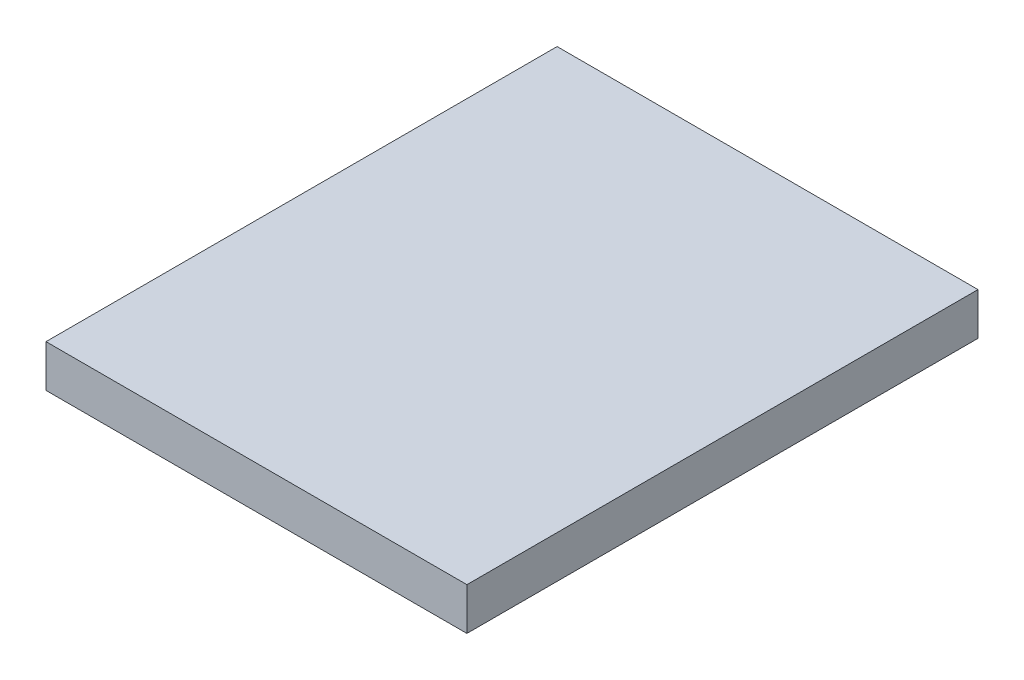
ISO-10303-21;
HEADER;
FILE_DESCRIPTION(('STEP AP214'),'2;1');
FILE_NAME('part.step','',(''),(''),'','','');
FILE_SCHEMA(('AUTOMOTIVE_DESIGN { 1 0 10303 214 1 1 1 1 }'));
ENDSEC;
DATA;
#1=APPLICATION_CONTEXT('core data for automotive mechanical design processes');
#2=APPLICATION_PROTOCOL_DEFINITION('international standard','automotive_design',2000,#1);
#3=PRODUCT_CONTEXT('',#1,'mechanical');
#4=PRODUCT('Part','Part','',(#3));
#5=PRODUCT_RELATED_PRODUCT_CATEGORY('part','',(#4));
#6=PRODUCT_DEFINITION_FORMATION('','',#4);
#7=PRODUCT_DEFINITION_CONTEXT('part definition',#1,'design');
#8=PRODUCT_DEFINITION('design','',#6,#7);
#9=PRODUCT_DEFINITION_SHAPE('','',#8);
#10=(LENGTH_UNIT() NAMED_UNIT(*) SI_UNIT(.MILLI.,.METRE.));
#11=(NAMED_UNIT(*) PLANE_ANGLE_UNIT() SI_UNIT($,.RADIAN.));
#12=(NAMED_UNIT(*) SI_UNIT($,.STERADIAN.) SOLID_ANGLE_UNIT());
#13=UNCERTAINTY_MEASURE_WITH_UNIT(LENGTH_MEASURE(1.E-05),#10,'distance_accuracy_value','');
#14=(GEOMETRIC_REPRESENTATION_CONTEXT(3) GLOBAL_UNCERTAINTY_ASSIGNED_CONTEXT((#13)) GLOBAL_UNIT_ASSIGNED_CONTEXT((#10,
#11,#12)) REPRESENTATION_CONTEXT('',''));
#15=CARTESIAN_POINT('',(0.,0.,0.));
#16=DIRECTION('',(0.,0.,1.));
#17=DIRECTION('',(1.,0.,0.));
#18=AXIS2_PLACEMENT_3D('',#15,#16,#17);
#19=CARTESIAN_POINT('',(0.,12.75,0.));
#20=DIRECTION('',(1.,0.,0.));
#21=DIRECTION('',(0.,0.,-1.));
#22=AXIS2_PLACEMENT_3D('',#19,#20,#21);
#23=PLANE('',#22);
#24=DIRECTION('',(0.,0.,1.));
#25=VECTOR('',#24,1.);
#26=CARTESIAN_POINT('',(0.,0.,0.));
#27=LINE('',#26,#25);
#28=CARTESIAN_POINT('',(0.,0.,-154.21));
#29=VERTEX_POINT('',#28);
#30=CARTESIAN_POINT('',(0.,0.,0.));
#31=VERTEX_POINT('',#30);
#32=EDGE_CURVE('E95',#29,#31,#27,.T.);
#33=ORIENTED_EDGE('',*,*,#32,.T.);
#34=DIRECTION('',(0.,-1.,0.));
#35=VECTOR('',#34,1.);
#36=CARTESIAN_POINT('',(0.,12.75,0.));
#37=LINE('',#36,#35);
#38=CARTESIAN_POINT('',(0.,12.75,0.));
#39=VERTEX_POINT('',#38);
#40=EDGE_CURVE('E11',#39,#31,#37,.T.);
#41=ORIENTED_EDGE('',*,*,#40,.F.);
#42=DIRECTION('',(0.,0.,1.));
#43=VECTOR('',#42,1.);
#44=CARTESIAN_POINT('',(0.,12.75,0.));
#45=LINE('',#44,#43);
#46=CARTESIAN_POINT('',(0.,12.75,-154.21));
#47=VERTEX_POINT('',#46);
#48=EDGE_CURVE('E83',#47,#39,#45,.T.);
#49=ORIENTED_EDGE('',*,*,#48,.F.);
#50=DIRECTION('',(0.,-1.,0.));
#51=VECTOR('',#50,1.);
#52=CARTESIAN_POINT('',(0.,12.75,-154.21));
#53=LINE('',#52,#51);
#54=EDGE_CURVE('E91',#47,#29,#53,.T.);
#55=ORIENTED_EDGE('',*,*,#54,.T.);
#56=EDGE_LOOP('',(#33,#41,#49,#55));
#57=FACE_BOUND('',#56,.T.);
#58=ADVANCED_FACE('F32',(#57),#23,.F.);
#59=CARTESIAN_POINT('',(0.,12.75,0.));
#60=DIRECTION('',(0.,0.,-1.));
#61=DIRECTION('',(-1.,0.,0.));
#62=AXIS2_PLACEMENT_3D('',#59,#60,#61);
#63=PLANE('',#62);
#64=DIRECTION('',(1.,0.,0.));
#65=VECTOR('',#64,1.);
#66=CARTESIAN_POINT('',(0.,0.,0.));
#67=LINE('',#66,#65);
#68=CARTESIAN_POINT('',(127.,0.,0.));
#69=VERTEX_POINT('',#68);
#70=EDGE_CURVE('E87',#31,#69,#67,.T.);
#71=ORIENTED_EDGE('',*,*,#70,.T.);
#72=DIRECTION('',(0.,-1.,0.));
#73=VECTOR('',#72,1.);
#74=CARTESIAN_POINT('',(127.,12.75,0.));
#75=LINE('',#74,#73);
#76=CARTESIAN_POINT('',(127.,12.75,0.));
#77=VERTEX_POINT('',#76);
#78=EDGE_CURVE('E40',#77,#69,#75,.T.);
#79=ORIENTED_EDGE('',*,*,#78,.F.);
#80=DIRECTION('',(1.,0.,0.));
#81=VECTOR('',#80,1.);
#82=CARTESIAN_POINT('',(0.,12.75,0.));
#83=LINE('',#82,#81);
#84=EDGE_CURVE('E78',#39,#77,#83,.T.);
#85=ORIENTED_EDGE('',*,*,#84,.F.);
#86=ORIENTED_EDGE('',*,*,#40,.T.);
#87=EDGE_LOOP('',(#71,#79,#85,#86));
#88=FACE_BOUND('',#87,.T.);
#89=ADVANCED_FACE('F86',(#88),#63,.F.);
#90=CARTESIAN_POINT('',(127.,12.75,0.));
#91=DIRECTION('',(-1.,0.,0.));
#92=DIRECTION('',(0.,0.,1.));
#93=AXIS2_PLACEMENT_3D('',#90,#91,#92);
#94=PLANE('',#93);
#95=DIRECTION('',(0.,0.,-1.));
#96=VECTOR('',#95,1.);
#97=CARTESIAN_POINT('',(127.,0.,0.));
#98=LINE('',#97,#96);
#99=CARTESIAN_POINT('',(127.,0.,-154.21));
#100=VERTEX_POINT('',#99);
#101=EDGE_CURVE('E65',#69,#100,#98,.T.);
#102=ORIENTED_EDGE('',*,*,#101,.T.);
#103=DIRECTION('',(0.,-1.,0.));
#104=VECTOR('',#103,1.);
#105=CARTESIAN_POINT('',(127.,12.75,-154.21));
#106=LINE('',#105,#104);
#107=CARTESIAN_POINT('',(127.,12.75,-154.21));
#108=VERTEX_POINT('',#107);
#109=EDGE_CURVE('E88',#108,#100,#106,.T.);
#110=ORIENTED_EDGE('',*,*,#109,.F.);
#111=DIRECTION('',(0.,0.,-1.));
#112=VECTOR('',#111,1.);
#113=CARTESIAN_POINT('',(127.,12.75,0.));
#114=LINE('',#113,#112);
#115=EDGE_CURVE('E81',#77,#108,#114,.T.);
#116=ORIENTED_EDGE('',*,*,#115,.F.);
#117=ORIENTED_EDGE('',*,*,#78,.T.);
#118=EDGE_LOOP('',(#102,#110,#116,#117));
#119=FACE_BOUND('',#118,.T.);
#120=ADVANCED_FACE('F89',(#119),#94,.F.);
#121=CARTESIAN_POINT('',(0.,12.75,-154.21));
#122=DIRECTION('',(0.,0.,1.));
#123=DIRECTION('',(1.,0.,0.));
#124=AXIS2_PLACEMENT_3D('',#121,#122,#123);
#125=PLANE('',#124);
#126=DIRECTION('',(-1.,0.,0.));
#127=VECTOR('',#126,1.);
#128=CARTESIAN_POINT('',(0.,0.,-154.21));
#129=LINE('',#128,#127);
#130=EDGE_CURVE('E71',#100,#29,#129,.T.);
#131=ORIENTED_EDGE('',*,*,#130,.T.);
#132=ORIENTED_EDGE('',*,*,#54,.F.);
#133=DIRECTION('',(-1.,0.,0.));
#134=VECTOR('',#133,1.);
#135=CARTESIAN_POINT('',(0.,12.75,-154.21));
#136=LINE('',#135,#134);
#137=EDGE_CURVE('E48',#108,#47,#136,.T.);
#138=ORIENTED_EDGE('',*,*,#137,.F.);
#139=ORIENTED_EDGE('',*,*,#109,.T.);
#140=EDGE_LOOP('',(#131,#132,#138,#139));
#141=FACE_BOUND('',#140,.T.);
#142=ADVANCED_FACE('F102',(#141),#125,.F.);
#143=CARTESIAN_POINT('',(0.,12.75,0.));
#144=DIRECTION('',(0.,-1.,0.));
#145=DIRECTION('',(0.,0.,-1.));
#146=AXIS2_PLACEMENT_3D('',#143,#144,#145);
#147=PLANE('',#146);
#148=ORIENTED_EDGE('',*,*,#48,.T.);
#149=ORIENTED_EDGE('',*,*,#84,.T.);
#150=ORIENTED_EDGE('',*,*,#115,.T.);
#151=ORIENTED_EDGE('',*,*,#137,.T.);
#152=EDGE_LOOP('',(#148,#149,#150,#151));
#153=FACE_BOUND('',#152,.T.);
#154=ADVANCED_FACE('F79',(#153),#147,.F.);
#155=CARTESIAN_POINT('',(0.,0.,0.));
#156=DIRECTION('',(0.,-1.,0.));
#157=DIRECTION('',(0.,0.,-1.));
#158=AXIS2_PLACEMENT_3D('',#155,#156,#157);
#159=PLANE('',#158);
#160=ORIENTED_EDGE('',*,*,#32,.F.);
#161=ORIENTED_EDGE('',*,*,#130,.F.);
#162=ORIENTED_EDGE('',*,*,#101,.F.);
#163=ORIENTED_EDGE('',*,*,#70,.F.);
#164=EDGE_LOOP('',(#160,#161,#162,#163));
#165=FACE_BOUND('',#164,.T.);
#166=ADVANCED_FACE('F105',(#165),#159,.T.);
#167=CLOSED_SHELL('',(#58,#89,#120,#142,#154,#166));
#168=MANIFOLD_SOLID_BREP('B2',#167);
#169=ADVANCED_BREP_SHAPE_REPRESENTATION('',(#18,#168),#14);
#170=SHAPE_DEFINITION_REPRESENTATION(#9,#169);
ENDSEC;
END-ISO-10303-21;
